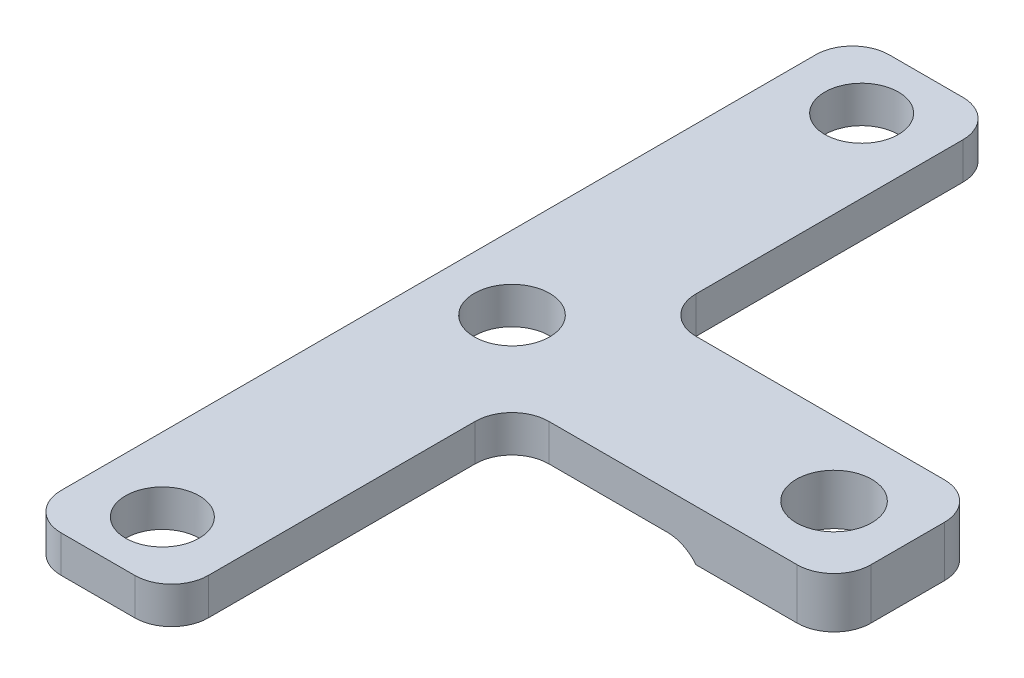
ISO-10303-21;
HEADER;
FILE_DESCRIPTION(('STEP AP214'),'2;1');
FILE_NAME('part.step','',(''),(''),'','','');
FILE_SCHEMA(('AUTOMOTIVE_DESIGN { 1 0 10303 214 1 1 1 1 }'));
ENDSEC;
DATA;
#1=APPLICATION_CONTEXT('core data for automotive mechanical design processes');
#2=APPLICATION_PROTOCOL_DEFINITION('international standard','automotive_design',2000,#1);
#3=PRODUCT_CONTEXT('',#1,'mechanical');
#4=PRODUCT('Part','Part','',(#3));
#5=PRODUCT_RELATED_PRODUCT_CATEGORY('part','',(#4));
#6=PRODUCT_DEFINITION_FORMATION('','',#4);
#7=PRODUCT_DEFINITION_CONTEXT('part definition',#1,'design');
#8=PRODUCT_DEFINITION('design','',#6,#7);
#9=PRODUCT_DEFINITION_SHAPE('','',#8);
#10=(LENGTH_UNIT() NAMED_UNIT(*) SI_UNIT(.MILLI.,.METRE.));
#11=(NAMED_UNIT(*) PLANE_ANGLE_UNIT() SI_UNIT($,.RADIAN.));
#12=(NAMED_UNIT(*) SI_UNIT($,.STERADIAN.) SOLID_ANGLE_UNIT());
#13=UNCERTAINTY_MEASURE_WITH_UNIT(LENGTH_MEASURE(1.E-05),#10,'distance_accuracy_value','');
#14=(GEOMETRIC_REPRESENTATION_CONTEXT(3) GLOBAL_UNCERTAINTY_ASSIGNED_CONTEXT((#13)) GLOBAL_UNIT_ASSIGNED_CONTEXT((#10,
#11,#12)) REPRESENTATION_CONTEXT('',''));
#15=CARTESIAN_POINT('',(0.,0.,0.));
#16=DIRECTION('',(0.,0.,1.));
#17=DIRECTION('',(1.,0.,0.));
#18=AXIS2_PLACEMENT_3D('',#15,#16,#17);
#19=CARTESIAN_POINT('',(0.,0.,0.));
#20=DIRECTION('',(0.,-1.,0.));
#21=DIRECTION('',(0.,0.,-1.));
#22=AXIS2_PLACEMENT_3D('',#19,#20,#21);
#23=PLANE('',#22);
#24=CARTESIAN_POINT('',(0.,0.,0.));
#25=DIRECTION('',(0.,1.,0.));
#26=DIRECTION('',(0.,0.,1.));
#27=AXIS2_PLACEMENT_3D('',#24,#25,#26);
#28=CIRCLE('',#27,4.1);
#29=CARTESIAN_POINT('',(0.,0.,4.1));
#30=VERTEX_POINT('',#29);
#31=EDGE_CURVE('E297',#30,#30,#28,.T.);
#32=ORIENTED_EDGE('',*,*,#31,.T.);
#33=EDGE_LOOP('',(#32));
#34=FACE_BOUND('',#33,.T.);
#35=CARTESIAN_POINT('',(0.,0.,38.));
#36=DIRECTION('',(0.,-1.,0.));
#37=DIRECTION('',(0.,0.,-1.));
#38=AXIS2_PLACEMENT_3D('',#35,#36,#37);
#39=CIRCLE('',#38,4.);
#40=CARTESIAN_POINT('',(0.,0.,34.));
#41=VERTEX_POINT('',#40);
#42=EDGE_CURVE('E293',#41,#41,#39,.T.);
#43=ORIENTED_EDGE('',*,*,#42,.F.);
#44=EDGE_LOOP('',(#43));
#45=FACE_BOUND('',#44,.T.);
#46=CARTESIAN_POINT('',(0.,0.,-38.));
#47=DIRECTION('',(0.,-1.,0.));
#48=DIRECTION('',(0.,0.,-1.));
#49=AXIS2_PLACEMENT_3D('',#46,#47,#48);
#50=CIRCLE('',#49,4.);
#51=CARTESIAN_POINT('',(0.,0.,-42.));
#52=VERTEX_POINT('',#51);
#53=EDGE_CURVE('E287',#52,#52,#50,.F.);
#54=ORIENTED_EDGE('',*,*,#53,.T.);
#55=EDGE_LOOP('',(#54));
#56=FACE_BOUND('',#55,.T.);
#57=DIRECTION('',(-1.,0.,0.));
#58=VECTOR('',#57,1.);
#59=CARTESIAN_POINT('',(8.00000000000001,0.,-8.));
#60=LINE('',#59,#58);
#61=CARTESIAN_POINT('',(24.8775010008008,0.,-8.));
#62=VERTEX_POINT('',#61);
#63=CARTESIAN_POINT('',(12.,0.,-8.));
#64=VERTEX_POINT('',#63);
#65=EDGE_CURVE('E322',#62,#64,#60,.T.);
#66=ORIENTED_EDGE('',*,*,#65,.F.);
#67=DIRECTION('',(0.,0.,-1.));
#68=VECTOR('',#67,1.);
#69=CARTESIAN_POINT('',(24.8775010008008,0.,8.));
#70=LINE('',#69,#68);
#71=CARTESIAN_POINT('',(24.8775010008008,0.,8.));
#72=VERTEX_POINT('',#71);
#73=EDGE_CURVE('E182',#62,#72,#70,.F.);
#74=ORIENTED_EDGE('',*,*,#73,.T.);
#75=DIRECTION('',(1.,0.,0.));
#76=VECTOR('',#75,1.);
#77=CARTESIAN_POINT('',(8.00000000000001,0.,8.));
#78=LINE('',#77,#76);
#79=CARTESIAN_POINT('',(12.,0.,8.));
#80=VERTEX_POINT('',#79);
#81=EDGE_CURVE('E298',#80,#72,#78,.T.);
#82=ORIENTED_EDGE('',*,*,#81,.F.);
#83=CARTESIAN_POINT('',(12.,0.,12.));
#84=DIRECTION('',(0.,-1.,0.));
#85=DIRECTION('',(0.,0.,-1.));
#86=AXIS2_PLACEMENT_3D('',#83,#84,#85);
#87=CIRCLE('',#86,4.);
#88=CARTESIAN_POINT('',(8.,0.,12.));
#89=VERTEX_POINT('',#88);
#90=EDGE_CURVE('E191',#80,#89,#87,.F.);
#91=ORIENTED_EDGE('',*,*,#90,.T.);
#92=DIRECTION('',(0.,0.,-1.));
#93=VECTOR('',#92,1.);
#94=CARTESIAN_POINT('',(8.00000000000001,0.,8.));
#95=LINE('',#94,#93);
#96=CARTESIAN_POINT('',(7.99999999999999,0.,41.));
#97=VERTEX_POINT('',#96);
#98=EDGE_CURVE('E302',#97,#89,#95,.T.);
#99=ORIENTED_EDGE('',*,*,#98,.F.);
#100=CARTESIAN_POINT('',(3.99999999999999,0.,41.));
#101=DIRECTION('',(0.,-1.,0.));
#102=DIRECTION('',(0.,0.,-1.));
#103=AXIS2_PLACEMENT_3D('',#100,#101,#102);
#104=CIRCLE('',#103,4.);
#105=CARTESIAN_POINT('',(3.99999999999999,0.,45.));
#106=VERTEX_POINT('',#105);
#107=EDGE_CURVE('E269',#97,#106,#104,.T.);
#108=ORIENTED_EDGE('',*,*,#107,.T.);
#109=DIRECTION('',(1.,0.,0.));
#110=VECTOR('',#109,1.);
#111=CARTESIAN_POINT('',(-7.99999999999999,0.,45.));
#112=LINE('',#111,#110);
#113=CARTESIAN_POINT('',(-3.99999999999999,0.,45.));
#114=VERTEX_POINT('',#113);
#115=EDGE_CURVE('E306',#114,#106,#112,.T.);
#116=ORIENTED_EDGE('',*,*,#115,.F.);
#117=CARTESIAN_POINT('',(-3.99999999999999,0.,41.));
#118=DIRECTION('',(0.,-1.,0.));
#119=DIRECTION('',(0.,0.,-1.));
#120=AXIS2_PLACEMENT_3D('',#117,#118,#119);
#121=CIRCLE('',#120,4.);
#122=CARTESIAN_POINT('',(-7.99999999999999,0.,41.));
#123=VERTEX_POINT('',#122);
#124=EDGE_CURVE('E278',#114,#123,#121,.T.);
#125=ORIENTED_EDGE('',*,*,#124,.T.);
#126=DIRECTION('',(0.,0.,1.));
#127=VECTOR('',#126,1.);
#128=CARTESIAN_POINT('',(-8.,0.,-45.));
#129=LINE('',#128,#127);
#130=CARTESIAN_POINT('',(-8.,0.,-41.));
#131=VERTEX_POINT('',#130);
#132=EDGE_CURVE('E310',#131,#123,#129,.T.);
#133=ORIENTED_EDGE('',*,*,#132,.F.);
#134=CARTESIAN_POINT('',(-4.,0.,-41.));
#135=DIRECTION('',(0.,-1.,0.));
#136=DIRECTION('',(0.,0.,-1.));
#137=AXIS2_PLACEMENT_3D('',#134,#135,#136);
#138=CIRCLE('',#137,4.);
#139=CARTESIAN_POINT('',(-4.,0.,-45.));
#140=VERTEX_POINT('',#139);
#141=EDGE_CURVE('E275',#131,#140,#138,.T.);
#142=ORIENTED_EDGE('',*,*,#141,.T.);
#143=DIRECTION('',(-1.,0.,0.));
#144=VECTOR('',#143,1.);
#145=CARTESIAN_POINT('',(-8.,0.,-45.));
#146=LINE('',#145,#144);
#147=CARTESIAN_POINT('',(4.,0.,-45.));
#148=VERTEX_POINT('',#147);
#149=EDGE_CURVE('E314',#148,#140,#146,.T.);
#150=ORIENTED_EDGE('',*,*,#149,.F.);
#151=CARTESIAN_POINT('',(4.,0.,-41.));
#152=DIRECTION('',(0.,-1.,0.));
#153=DIRECTION('',(0.,0.,-1.));
#154=AXIS2_PLACEMENT_3D('',#151,#152,#153);
#155=CIRCLE('',#154,4.);
#156=CARTESIAN_POINT('',(8.,0.,-41.));
#157=VERTEX_POINT('',#156);
#158=EDGE_CURVE('E272',#148,#157,#155,.T.);
#159=ORIENTED_EDGE('',*,*,#158,.T.);
#160=DIRECTION('',(0.,0.,-1.));
#161=VECTOR('',#160,1.);
#162=CARTESIAN_POINT('',(8.,0.,-45.));
#163=LINE('',#162,#161);
#164=CARTESIAN_POINT('',(8.00000000000001,0.,-12.));
#165=VERTEX_POINT('',#164);
#166=EDGE_CURVE('E318',#165,#157,#163,.T.);
#167=ORIENTED_EDGE('',*,*,#166,.F.);
#168=CARTESIAN_POINT('',(12.,0.,-12.));
#169=DIRECTION('',(0.,-1.,0.));
#170=DIRECTION('',(0.,0.,-1.));
#171=AXIS2_PLACEMENT_3D('',#168,#169,#170);
#172=CIRCLE('',#171,4.);
#173=EDGE_CURVE('E199',#165,#64,#172,.F.);
#174=ORIENTED_EDGE('',*,*,#173,.T.);
#175=EDGE_LOOP('',(#66,#74,#82,#91,#99,#108,#116,#125,#133,#142,#150,#159,#167,#174));
#176=FACE_BOUND('',#175,.T.);
#177=ADVANCED_FACE('F39',(#34,#45,#56,#176),#23,.T.);
#178=CARTESIAN_POINT('',(0.,4.,0.));
#179=DIRECTION('',(0.,-1.,0.));
#180=DIRECTION('',(0.,0.,-1.));
#181=AXIS2_PLACEMENT_3D('',#178,#179,#180);
#182=PLANE('',#181);
#183=CARTESIAN_POINT('',(35.,4.,0.));
#184=DIRECTION('',(0.,1.,0.));
#185=DIRECTION('',(0.,0.,1.));
#186=AXIS2_PLACEMENT_3D('',#183,#184,#185);
#187=CIRCLE('',#186,4.1);
#188=CARTESIAN_POINT('',(35.,4.,4.1));
#189=VERTEX_POINT('',#188);
#190=EDGE_CURVE('E368',#189,#189,#187,.T.);
#191=ORIENTED_EDGE('',*,*,#190,.F.);
#192=EDGE_LOOP('',(#191));
#193=FACE_BOUND('',#192,.T.);
#194=CARTESIAN_POINT('',(0.,4.,-38.));
#195=DIRECTION('',(0.,-1.,0.));
#196=DIRECTION('',(0.,0.,-1.));
#197=AXIS2_PLACEMENT_3D('',#194,#195,#196);
#198=CIRCLE('',#197,4.);
#199=CARTESIAN_POINT('',(0.,4.,-42.));
#200=VERTEX_POINT('',#199);
#201=EDGE_CURVE('E292',#200,#200,#198,.T.);
#202=ORIENTED_EDGE('',*,*,#201,.T.);
#203=EDGE_LOOP('',(#202));
#204=FACE_BOUND('',#203,.T.);
#205=CARTESIAN_POINT('',(0.,4.,38.));
#206=DIRECTION('',(0.,1.,0.));
#207=DIRECTION('',(0.,0.,1.));
#208=AXIS2_PLACEMENT_3D('',#205,#206,#207);
#209=CIRCLE('',#208,4.);
#210=CARTESIAN_POINT('',(0.,4.,42.));
#211=VERTEX_POINT('',#210);
#212=EDGE_CURVE('E291',#211,#211,#209,.T.);
#213=ORIENTED_EDGE('',*,*,#212,.F.);
#214=EDGE_LOOP('',(#213));
#215=FACE_BOUND('',#214,.T.);
#216=DIRECTION('',(0.,0.,-1.));
#217=VECTOR('',#216,1.);
#218=CARTESIAN_POINT('',(43.,4.,-8.));
#219=LINE('',#218,#217);
#220=CARTESIAN_POINT('',(43.,4.,4.));
#221=VERTEX_POINT('',#220);
#222=CARTESIAN_POINT('',(43.,4.,-4.));
#223=VERTEX_POINT('',#222);
#224=EDGE_CURVE('E286',#221,#223,#219,.T.);
#225=ORIENTED_EDGE('',*,*,#224,.T.);
#226=CARTESIAN_POINT('',(39.,4.,-4.));
#227=DIRECTION('',(0.,-1.,0.));
#228=DIRECTION('',(0.,0.,-1.));
#229=AXIS2_PLACEMENT_3D('',#226,#227,#228);
#230=CIRCLE('',#229,4.);
#231=CARTESIAN_POINT('',(39.,4.,-8.));
#232=VERTEX_POINT('',#231);
#233=EDGE_CURVE('E245',#223,#232,#230,.F.);
#234=ORIENTED_EDGE('',*,*,#233,.T.);
#235=DIRECTION('',(-1.,0.,0.));
#236=VECTOR('',#235,1.);
#237=CARTESIAN_POINT('',(8.00000000000001,4.,-8.));
#238=LINE('',#237,#236);
#239=CARTESIAN_POINT('',(12.,4.,-8.));
#240=VERTEX_POINT('',#239);
#241=EDGE_CURVE('E301',#232,#240,#238,.T.);
#242=ORIENTED_EDGE('',*,*,#241,.T.);
#243=CARTESIAN_POINT('',(12.,4.,-12.));
#244=DIRECTION('',(0.,-1.,0.));
#245=DIRECTION('',(0.,0.,-1.));
#246=AXIS2_PLACEMENT_3D('',#243,#244,#245);
#247=CIRCLE('',#246,4.);
#248=CARTESIAN_POINT('',(8.00000000000001,4.,-12.));
#249=VERTEX_POINT('',#248);
#250=EDGE_CURVE('E196',#240,#249,#247,.T.);
#251=ORIENTED_EDGE('',*,*,#250,.T.);
#252=DIRECTION('',(0.,0.,-1.));
#253=VECTOR('',#252,1.);
#254=CARTESIAN_POINT('',(8.,4.,-45.));
#255=LINE('',#254,#253);
#256=CARTESIAN_POINT('',(8.,4.,-41.));
#257=VERTEX_POINT('',#256);
#258=EDGE_CURVE('E349',#249,#257,#255,.T.);
#259=ORIENTED_EDGE('',*,*,#258,.T.);
#260=CARTESIAN_POINT('',(4.,4.,-41.));
#261=DIRECTION('',(0.,-1.,0.));
#262=DIRECTION('',(0.,0.,-1.));
#263=AXIS2_PLACEMENT_3D('',#260,#261,#262);
#264=CIRCLE('',#263,4.);
#265=CARTESIAN_POINT('',(4.,4.,-45.));
#266=VERTEX_POINT('',#265);
#267=EDGE_CURVE('E254',#257,#266,#264,.F.);
#268=ORIENTED_EDGE('',*,*,#267,.T.);
#269=DIRECTION('',(-1.,0.,0.));
#270=VECTOR('',#269,1.);
#271=CARTESIAN_POINT('',(-8.,4.,-45.));
#272=LINE('',#271,#270);
#273=CARTESIAN_POINT('',(-4.,4.,-45.));
#274=VERTEX_POINT('',#273);
#275=EDGE_CURVE('E345',#266,#274,#272,.T.);
#276=ORIENTED_EDGE('',*,*,#275,.T.);
#277=CARTESIAN_POINT('',(-4.,4.,-41.));
#278=DIRECTION('',(0.,-1.,0.));
#279=DIRECTION('',(0.,0.,-1.));
#280=AXIS2_PLACEMENT_3D('',#277,#278,#279);
#281=CIRCLE('',#280,4.);
#282=CARTESIAN_POINT('',(-8.,4.,-41.));
#283=VERTEX_POINT('',#282);
#284=EDGE_CURVE('E257',#274,#283,#281,.F.);
#285=ORIENTED_EDGE('',*,*,#284,.T.);
#286=DIRECTION('',(0.,0.,1.));
#287=VECTOR('',#286,1.);
#288=CARTESIAN_POINT('',(-8.,4.,-45.));
#289=LINE('',#288,#287);
#290=CARTESIAN_POINT('',(-7.99999999999999,4.,41.));
#291=VERTEX_POINT('',#290);
#292=EDGE_CURVE('E341',#283,#291,#289,.T.);
#293=ORIENTED_EDGE('',*,*,#292,.T.);
#294=CARTESIAN_POINT('',(-3.99999999999999,4.,41.));
#295=DIRECTION('',(0.,-1.,0.));
#296=DIRECTION('',(0.,0.,-1.));
#297=AXIS2_PLACEMENT_3D('',#294,#295,#296);
#298=CIRCLE('',#297,4.);
#299=CARTESIAN_POINT('',(-3.99999999999999,4.,45.));
#300=VERTEX_POINT('',#299);
#301=EDGE_CURVE('E260',#291,#300,#298,.F.);
#302=ORIENTED_EDGE('',*,*,#301,.T.);
#303=DIRECTION('',(1.,0.,0.));
#304=VECTOR('',#303,1.);
#305=CARTESIAN_POINT('',(-7.99999999999999,4.,45.));
#306=LINE('',#305,#304);
#307=CARTESIAN_POINT('',(3.99999999999999,4.,45.));
#308=VERTEX_POINT('',#307);
#309=EDGE_CURVE('E337',#300,#308,#306,.T.);
#310=ORIENTED_EDGE('',*,*,#309,.T.);
#311=CARTESIAN_POINT('',(3.99999999999999,4.,41.));
#312=DIRECTION('',(0.,-1.,0.));
#313=DIRECTION('',(0.,0.,-1.));
#314=AXIS2_PLACEMENT_3D('',#311,#312,#313);
#315=CIRCLE('',#314,4.);
#316=CARTESIAN_POINT('',(7.99999999999999,4.,41.));
#317=VERTEX_POINT('',#316);
#318=EDGE_CURVE('E251',#308,#317,#315,.F.);
#319=ORIENTED_EDGE('',*,*,#318,.T.);
#320=DIRECTION('',(0.,0.,-1.));
#321=VECTOR('',#320,1.);
#322=CARTESIAN_POINT('',(8.00000000000001,4.,8.));
#323=LINE('',#322,#321);
#324=CARTESIAN_POINT('',(8.,4.,12.));
#325=VERTEX_POINT('',#324);
#326=EDGE_CURVE('E333',#317,#325,#323,.T.);
#327=ORIENTED_EDGE('',*,*,#326,.T.);
#328=CARTESIAN_POINT('',(12.,4.,12.));
#329=DIRECTION('',(0.,-1.,0.));
#330=DIRECTION('',(0.,0.,-1.));
#331=AXIS2_PLACEMENT_3D('',#328,#329,#330);
#332=CIRCLE('',#331,4.);
#333=CARTESIAN_POINT('',(12.,4.,8.));
#334=VERTEX_POINT('',#333);
#335=EDGE_CURVE('E187',#325,#334,#332,.T.);
#336=ORIENTED_EDGE('',*,*,#335,.T.);
#337=DIRECTION('',(1.,0.,0.));
#338=VECTOR('',#337,1.);
#339=CARTESIAN_POINT('',(8.00000000000001,4.,8.));
#340=LINE('',#339,#338);
#341=CARTESIAN_POINT('',(39.,4.,8.));
#342=VERTEX_POINT('',#341);
#343=EDGE_CURVE('E329',#334,#342,#340,.T.);
#344=ORIENTED_EDGE('',*,*,#343,.T.);
#345=CARTESIAN_POINT('',(39.,4.,4.));
#346=DIRECTION('',(0.,-1.,0.));
#347=DIRECTION('',(0.,0.,-1.));
#348=AXIS2_PLACEMENT_3D('',#345,#346,#347);
#349=CIRCLE('',#348,4.);
#350=EDGE_CURVE('E248',#342,#221,#349,.F.);
#351=ORIENTED_EDGE('',*,*,#350,.T.);
#352=EDGE_LOOP('',(#225,#234,#242,#251,#259,#268,#276,#285,#293,#302,#310,#319,#327,#336,#344,#351));
#353=FACE_BOUND('',#352,.T.);
#354=CARTESIAN_POINT('',(0.,4.,0.));
#355=DIRECTION('',(0.,1.,0.));
#356=DIRECTION('',(0.,0.,1.));
#357=AXIS2_PLACEMENT_3D('',#354,#355,#356);
#358=CIRCLE('',#357,4.1);
#359=CARTESIAN_POINT('',(0.,4.,4.1));
#360=VERTEX_POINT('',#359);
#361=EDGE_CURVE('E325',#360,#360,#358,.T.);
#362=ORIENTED_EDGE('',*,*,#361,.F.);
#363=EDGE_LOOP('',(#362));
#364=FACE_BOUND('',#363,.T.);
#365=ADVANCED_FACE('F410',(#193,#204,#215,#353,#364),#182,.F.);
#366=CARTESIAN_POINT('',(8.00000000000001,4.,-8.));
#367=DIRECTION('',(0.,0.,1.));
#368=DIRECTION('',(1.,0.,0.));
#369=AXIS2_PLACEMENT_3D('',#366,#367,#368);
#370=PLANE('',#369);
#371=ORIENTED_EDGE('',*,*,#241,.F.);
#372=DIRECTION('',(0.,-1.,0.));
#373=VECTOR('',#372,1.);
#374=CARTESIAN_POINT('',(39.,4.,-8.));
#375=LINE('',#374,#373);
#376=CARTESIAN_POINT('',(39.,-1.5,-8.));
#377=VERTEX_POINT('',#376);
#378=EDGE_CURVE('E166',#232,#377,#375,.T.);
#379=ORIENTED_EDGE('',*,*,#378,.T.);
#380=DIRECTION('',(1.,0.,0.));
#381=VECTOR('',#380,1.);
#382=CARTESIAN_POINT('',(0.,-1.5,-8.));
#383=LINE('',#382,#381);
#384=CARTESIAN_POINT('',(28.,-1.5,-8.));
#385=VERTEX_POINT('',#384);
#386=EDGE_CURVE('E161',#385,#377,#383,.T.);
#387=ORIENTED_EDGE('',*,*,#386,.F.);
#388=CARTESIAN_POINT('',(24.8775010008008,-4.,-8.));
#389=DIRECTION('',(0.,0.,1.));
#390=DIRECTION('',(1.,0.,0.));
#391=AXIS2_PLACEMENT_3D('',#388,#389,#390);
#392=CIRCLE('',#391,4.);
#393=EDGE_CURVE('E11',#385,#62,#392,.T.);
#394=ORIENTED_EDGE('',*,*,#393,.T.);
#395=ORIENTED_EDGE('',*,*,#65,.T.);
#396=DIRECTION('',(0.,-1.,0.));
#397=VECTOR('',#396,1.);
#398=CARTESIAN_POINT('',(12.,4.,-8.));
#399=LINE('',#398,#397);
#400=EDGE_CURVE('E283',#64,#240,#399,.F.);
#401=ORIENTED_EDGE('',*,*,#400,.T.);
#402=EDGE_LOOP('',(#371,#379,#387,#394,#395,#401));
#403=FACE_BOUND('',#402,.T.);
#404=ADVANCED_FACE('F164',(#403),#370,.F.);
#405=CARTESIAN_POINT('',(8.,4.,-45.));
#406=DIRECTION('',(-1.,0.,0.));
#407=DIRECTION('',(0.,0.,1.));
#408=AXIS2_PLACEMENT_3D('',#405,#406,#407);
#409=PLANE('',#408);
#410=ORIENTED_EDGE('',*,*,#258,.F.);
#411=DIRECTION('',(0.,-1.,0.));
#412=VECTOR('',#411,1.);
#413=CARTESIAN_POINT('',(8.00000000000001,0.,-12.));
#414=LINE('',#413,#412);
#415=EDGE_CURVE('E231',#249,#165,#414,.T.);
#416=ORIENTED_EDGE('',*,*,#415,.T.);
#417=ORIENTED_EDGE('',*,*,#166,.T.);
#418=DIRECTION('',(0.,-1.,0.));
#419=VECTOR('',#418,1.);
#420=CARTESIAN_POINT('',(8.,4.,-41.));
#421=LINE('',#420,#419);
#422=EDGE_CURVE('E235',#157,#257,#421,.F.);
#423=ORIENTED_EDGE('',*,*,#422,.T.);
#424=EDGE_LOOP('',(#410,#416,#417,#423));
#425=FACE_BOUND('',#424,.T.);
#426=ADVANCED_FACE('F446',(#425),#409,.F.);
#427=CARTESIAN_POINT('',(-8.,4.,-45.));
#428=DIRECTION('',(0.,0.,1.));
#429=DIRECTION('',(1.,0.,0.));
#430=AXIS2_PLACEMENT_3D('',#427,#428,#429);
#431=PLANE('',#430);
#432=ORIENTED_EDGE('',*,*,#275,.F.);
#433=DIRECTION('',(0.,-1.,0.));
#434=VECTOR('',#433,1.);
#435=CARTESIAN_POINT('',(4.,4.,-45.));
#436=LINE('',#435,#434);
#437=EDGE_CURVE('E210',#266,#148,#436,.T.);
#438=ORIENTED_EDGE('',*,*,#437,.T.);
#439=ORIENTED_EDGE('',*,*,#149,.T.);
#440=DIRECTION('',(0.,-1.,0.));
#441=VECTOR('',#440,1.);
#442=CARTESIAN_POINT('',(-4.,4.,-45.));
#443=LINE('',#442,#441);
#444=EDGE_CURVE('E214',#140,#274,#443,.F.);
#445=ORIENTED_EDGE('',*,*,#444,.T.);
#446=EDGE_LOOP('',(#432,#438,#439,#445));
#447=FACE_BOUND('',#446,.T.);
#448=ADVANCED_FACE('F437',(#447),#431,.F.);
#449=CARTESIAN_POINT('',(-8.,4.,-45.));
#450=DIRECTION('',(1.,0.,0.));
#451=DIRECTION('',(0.,0.,-1.));
#452=AXIS2_PLACEMENT_3D('',#449,#450,#451);
#453=PLANE('',#452);
#454=ORIENTED_EDGE('',*,*,#292,.F.);
#455=DIRECTION('',(0.,-1.,0.));
#456=VECTOR('',#455,1.);
#457=CARTESIAN_POINT('',(-8.,4.,-41.));
#458=LINE('',#457,#456);
#459=EDGE_CURVE('E203',#283,#131,#458,.T.);
#460=ORIENTED_EDGE('',*,*,#459,.T.);
#461=ORIENTED_EDGE('',*,*,#132,.T.);
#462=DIRECTION('',(0.,-1.,0.));
#463=VECTOR('',#462,1.);
#464=CARTESIAN_POINT('',(-7.99999999999999,4.,41.));
#465=LINE('',#464,#463);
#466=EDGE_CURVE('E207',#123,#291,#465,.F.);
#467=ORIENTED_EDGE('',*,*,#466,.T.);
#468=EDGE_LOOP('',(#454,#460,#461,#467));
#469=FACE_BOUND('',#468,.T.);
#470=ADVANCED_FACE('F428',(#469),#453,.F.);
#471=CARTESIAN_POINT('',(-7.99999999999999,4.,45.));
#472=DIRECTION('',(0.,0.,-1.));
#473=DIRECTION('',(-1.,0.,0.));
#474=AXIS2_PLACEMENT_3D('',#471,#472,#473);
#475=PLANE('',#474);
#476=ORIENTED_EDGE('',*,*,#115,.T.);
#477=DIRECTION('',(0.,-1.,0.));
#478=VECTOR('',#477,1.);
#479=CARTESIAN_POINT('',(3.99999999999999,4.,45.));
#480=LINE('',#479,#478);
#481=EDGE_CURVE('E217',#106,#308,#480,.F.);
#482=ORIENTED_EDGE('',*,*,#481,.T.);
#483=ORIENTED_EDGE('',*,*,#309,.F.);
#484=DIRECTION('',(0.,-1.,0.));
#485=VECTOR('',#484,1.);
#486=CARTESIAN_POINT('',(-3.99999999999999,4.,45.));
#487=LINE('',#486,#485);
#488=EDGE_CURVE('E220',#300,#114,#487,.T.);
#489=ORIENTED_EDGE('',*,*,#488,.T.);
#490=EDGE_LOOP('',(#476,#482,#483,#489));
#491=FACE_BOUND('',#490,.T.);
#492=ADVANCED_FACE('F418',(#491),#475,.F.);
#493=CARTESIAN_POINT('',(8.00000000000001,4.,8.));
#494=DIRECTION('',(-1.,0.,0.));
#495=DIRECTION('',(0.,0.,1.));
#496=AXIS2_PLACEMENT_3D('',#493,#494,#495);
#497=PLANE('',#496);
#498=ORIENTED_EDGE('',*,*,#98,.T.);
#499=DIRECTION('',(0.,-1.,0.));
#500=VECTOR('',#499,1.);
#501=CARTESIAN_POINT('',(8.,4.,12.));
#502=LINE('',#501,#500);
#503=EDGE_CURVE('E224',#89,#325,#502,.F.);
#504=ORIENTED_EDGE('',*,*,#503,.T.);
#505=ORIENTED_EDGE('',*,*,#326,.F.);
#506=DIRECTION('',(0.,-1.,0.));
#507=VECTOR('',#506,1.);
#508=CARTESIAN_POINT('',(7.99999999999999,4.,41.));
#509=LINE('',#508,#507);
#510=EDGE_CURVE('E227',#317,#97,#509,.T.);
#511=ORIENTED_EDGE('',*,*,#510,.T.);
#512=EDGE_LOOP('',(#498,#504,#505,#511));
#513=FACE_BOUND('',#512,.T.);
#514=ADVANCED_FACE('F404',(#513),#497,.F.);
#515=CARTESIAN_POINT('',(8.00000000000001,4.,8.));
#516=DIRECTION('',(0.,0.,-1.));
#517=DIRECTION('',(-1.,0.,0.));
#518=AXIS2_PLACEMENT_3D('',#515,#516,#517);
#519=PLANE('',#518);
#520=ORIENTED_EDGE('',*,*,#81,.T.);
#521=CARTESIAN_POINT('',(24.8775010008008,-4.,8.));
#522=DIRECTION('',(0.,0.,-1.));
#523=DIRECTION('',(-1.,0.,0.));
#524=AXIS2_PLACEMENT_3D('',#521,#522,#523);
#525=CIRCLE('',#524,4.);
#526=CARTESIAN_POINT('',(28.,-1.5,8.));
#527=VERTEX_POINT('',#526);
#528=EDGE_CURVE('E48',#72,#527,#525,.T.);
#529=ORIENTED_EDGE('',*,*,#528,.T.);
#530=DIRECTION('',(-1.,0.,0.));
#531=VECTOR('',#530,1.);
#532=CARTESIAN_POINT('',(0.,-1.5,8.));
#533=LINE('',#532,#531);
#534=CARTESIAN_POINT('',(39.,-1.5,8.));
#535=VERTEX_POINT('',#534);
#536=EDGE_CURVE('E179',#535,#527,#533,.T.);
#537=ORIENTED_EDGE('',*,*,#536,.F.);
#538=DIRECTION('',(0.,-1.,0.));
#539=VECTOR('',#538,1.);
#540=CARTESIAN_POINT('',(39.,4.,8.));
#541=LINE('',#540,#539);
#542=EDGE_CURVE('E238',#535,#342,#541,.F.);
#543=ORIENTED_EDGE('',*,*,#542,.T.);
#544=ORIENTED_EDGE('',*,*,#343,.F.);
#545=DIRECTION('',(0.,-1.,0.));
#546=VECTOR('',#545,1.);
#547=CARTESIAN_POINT('',(12.,0.,8.));
#548=LINE('',#547,#546);
#549=EDGE_CURVE('E241',#334,#80,#548,.T.);
#550=ORIENTED_EDGE('',*,*,#549,.T.);
#551=EDGE_LOOP('',(#520,#529,#537,#543,#544,#550));
#552=FACE_BOUND('',#551,.T.);
#553=ADVANCED_FACE('F397',(#552),#519,.F.);
#554=CARTESIAN_POINT('',(43.,4.,-8.));
#555=DIRECTION('',(-1.,0.,0.));
#556=DIRECTION('',(0.,0.,1.));
#557=AXIS2_PLACEMENT_3D('',#554,#555,#556);
#558=PLANE('',#557);
#559=DIRECTION('',(0.,-1.,0.));
#560=VECTOR('',#559,1.);
#561=CARTESIAN_POINT('',(43.,4.,4.));
#562=LINE('',#561,#560);
#563=CARTESIAN_POINT('',(43.,-1.5,4.));
#564=VERTEX_POINT('',#563);
#565=EDGE_CURVE('E266',#221,#564,#562,.T.);
#566=ORIENTED_EDGE('',*,*,#565,.T.);
#567=DIRECTION('',(0.,0.,1.));
#568=VECTOR('',#567,1.);
#569=CARTESIAN_POINT('',(43.,-1.5,0.));
#570=LINE('',#569,#568);
#571=CARTESIAN_POINT('',(43.,-1.5,-4.));
#572=VERTEX_POINT('',#571);
#573=EDGE_CURVE('E381',#572,#564,#570,.T.);
#574=ORIENTED_EDGE('',*,*,#573,.F.);
#575=DIRECTION('',(0.,-1.,0.));
#576=VECTOR('',#575,1.);
#577=CARTESIAN_POINT('',(43.,4.,-4.));
#578=LINE('',#577,#576);
#579=EDGE_CURVE('E263',#572,#223,#578,.F.);
#580=ORIENTED_EDGE('',*,*,#579,.T.);
#581=ORIENTED_EDGE('',*,*,#224,.F.);
#582=EDGE_LOOP('',(#566,#574,#580,#581));
#583=FACE_BOUND('',#582,.T.);
#584=ADVANCED_FACE('F390',(#583),#558,.F.);
#585=CARTESIAN_POINT('',(0.,4.,0.));
#586=DIRECTION('',(0.,-1.,0.));
#587=DIRECTION('',(0.,0.,-1.));
#588=AXIS2_PLACEMENT_3D('',#585,#586,#587);
#589=CYLINDRICAL_SURFACE('',#588,4.1);
#590=ORIENTED_EDGE('',*,*,#361,.T.);
#591=EDGE_LOOP('',(#590));
#592=FACE_BOUND('',#591,.T.);
#593=ORIENTED_EDGE('',*,*,#31,.F.);
#594=EDGE_LOOP('',(#593));
#595=FACE_BOUND('',#594,.T.);
#596=ADVANCED_FACE('F479',(#592,#595),#589,.F.);
#597=CARTESIAN_POINT('',(0.,-6.,38.));
#598=DIRECTION('',(0.,1.,0.));
#599=DIRECTION('',(0.,0.,1.));
#600=AXIS2_PLACEMENT_3D('',#597,#598,#599);
#601=CYLINDRICAL_SURFACE('',#600,4.);
#602=ORIENTED_EDGE('',*,*,#42,.T.);
#603=EDGE_LOOP('',(#602));
#604=FACE_BOUND('',#603,.T.);
#605=ORIENTED_EDGE('',*,*,#212,.T.);
#606=EDGE_LOOP('',(#605));
#607=FACE_BOUND('',#606,.T.);
#608=ADVANCED_FACE('F462',(#604,#607),#601,.F.);
#609=CARTESIAN_POINT('',(0.,-6.,-38.));
#610=DIRECTION('',(0.,1.,0.));
#611=DIRECTION('',(0.,0.,1.));
#612=AXIS2_PLACEMENT_3D('',#609,#610,#611);
#613=CYLINDRICAL_SURFACE('',#612,4.);
#614=ORIENTED_EDGE('',*,*,#53,.F.);
#615=EDGE_LOOP('',(#614));
#616=FACE_BOUND('',#615,.T.);
#617=ORIENTED_EDGE('',*,*,#201,.F.);
#618=EDGE_LOOP('',(#617));
#619=FACE_BOUND('',#618,.T.);
#620=ADVANCED_FACE('F455',(#616,#619),#613,.F.);
#621=CARTESIAN_POINT('',(39.,4.,-4.));
#622=DIRECTION('',(0.,-1.,0.));
#623=DIRECTION('',(0.,0.,-1.));
#624=AXIS2_PLACEMENT_3D('',#621,#622,#623);
#625=CYLINDRICAL_SURFACE('',#624,4.);
#626=ORIENTED_EDGE('',*,*,#233,.F.);
#627=ORIENTED_EDGE('',*,*,#579,.F.);
#628=CARTESIAN_POINT('',(39.,-1.5,-4.));
#629=DIRECTION('',(0.,-1.,0.));
#630=DIRECTION('',(0.,0.,-1.));
#631=AXIS2_PLACEMENT_3D('',#628,#629,#630);
#632=CIRCLE('',#631,4.);
#633=EDGE_CURVE('E171',#377,#572,#632,.T.);
#634=ORIENTED_EDGE('',*,*,#633,.F.);
#635=ORIENTED_EDGE('',*,*,#378,.F.);
#636=EDGE_LOOP('',(#626,#627,#634,#635));
#637=FACE_BOUND('',#636,.T.);
#638=ADVANCED_FACE('F453',(#637),#625,.T.);
#639=CARTESIAN_POINT('',(39.,4.,4.));
#640=DIRECTION('',(0.,-1.,0.));
#641=DIRECTION('',(0.,0.,-1.));
#642=AXIS2_PLACEMENT_3D('',#639,#640,#641);
#643=CYLINDRICAL_SURFACE('',#642,4.);
#644=ORIENTED_EDGE('',*,*,#350,.F.);
#645=ORIENTED_EDGE('',*,*,#542,.F.);
#646=CARTESIAN_POINT('',(39.,-1.5,4.));
#647=DIRECTION('',(0.,-1.,0.));
#648=DIRECTION('',(0.,0.,-1.));
#649=AXIS2_PLACEMENT_3D('',#646,#647,#648);
#650=CIRCLE('',#649,4.);
#651=EDGE_CURVE('E378',#564,#535,#650,.T.);
#652=ORIENTED_EDGE('',*,*,#651,.F.);
#653=ORIENTED_EDGE('',*,*,#565,.F.);
#654=EDGE_LOOP('',(#644,#645,#652,#653));
#655=FACE_BOUND('',#654,.T.);
#656=ADVANCED_FACE('F395',(#655),#643,.T.);
#657=CARTESIAN_POINT('',(12.,4.,-12.));
#658=DIRECTION('',(0.,1.,0.));
#659=DIRECTION('',(0.,0.,1.));
#660=AXIS2_PLACEMENT_3D('',#657,#658,#659);
#661=CYLINDRICAL_SURFACE('',#660,4.);
#662=ORIENTED_EDGE('',*,*,#250,.F.);
#663=ORIENTED_EDGE('',*,*,#400,.F.);
#664=ORIENTED_EDGE('',*,*,#173,.F.);
#665=ORIENTED_EDGE('',*,*,#415,.F.);
#666=EDGE_LOOP('',(#662,#663,#664,#665));
#667=FACE_BOUND('',#666,.T.);
#668=ADVANCED_FACE('F450',(#667),#661,.F.);
#669=CARTESIAN_POINT('',(12.,4.,12.));
#670=DIRECTION('',(0.,1.,0.));
#671=DIRECTION('',(0.,0.,1.));
#672=AXIS2_PLACEMENT_3D('',#669,#670,#671);
#673=CYLINDRICAL_SURFACE('',#672,4.);
#674=ORIENTED_EDGE('',*,*,#335,.F.);
#675=ORIENTED_EDGE('',*,*,#503,.F.);
#676=ORIENTED_EDGE('',*,*,#90,.F.);
#677=ORIENTED_EDGE('',*,*,#549,.F.);
#678=EDGE_LOOP('',(#674,#675,#676,#677));
#679=FACE_BOUND('',#678,.T.);
#680=ADVANCED_FACE('F408',(#679),#673,.F.);
#681=CARTESIAN_POINT('',(3.99999999999999,4.,41.));
#682=DIRECTION('',(0.,-1.,0.));
#683=DIRECTION('',(0.,0.,-1.));
#684=AXIS2_PLACEMENT_3D('',#681,#682,#683);
#685=CYLINDRICAL_SURFACE('',#684,4.);
#686=ORIENTED_EDGE('',*,*,#318,.F.);
#687=ORIENTED_EDGE('',*,*,#481,.F.);
#688=ORIENTED_EDGE('',*,*,#107,.F.);
#689=ORIENTED_EDGE('',*,*,#510,.F.);
#690=EDGE_LOOP('',(#686,#687,#688,#689));
#691=FACE_BOUND('',#690,.T.);
#692=ADVANCED_FACE('F414',(#691),#685,.T.);
#693=CARTESIAN_POINT('',(4.,4.,-41.));
#694=DIRECTION('',(0.,-1.,0.));
#695=DIRECTION('',(0.,0.,-1.));
#696=AXIS2_PLACEMENT_3D('',#693,#694,#695);
#697=CYLINDRICAL_SURFACE('',#696,4.);
#698=ORIENTED_EDGE('',*,*,#267,.F.);
#699=ORIENTED_EDGE('',*,*,#422,.F.);
#700=ORIENTED_EDGE('',*,*,#158,.F.);
#701=ORIENTED_EDGE('',*,*,#437,.F.);
#702=EDGE_LOOP('',(#698,#699,#700,#701));
#703=FACE_BOUND('',#702,.T.);
#704=ADVANCED_FACE('F441',(#703),#697,.T.);
#705=CARTESIAN_POINT('',(-4.,4.,-41.));
#706=DIRECTION('',(0.,-1.,0.));
#707=DIRECTION('',(0.,0.,-1.));
#708=AXIS2_PLACEMENT_3D('',#705,#706,#707);
#709=CYLINDRICAL_SURFACE('',#708,4.);
#710=ORIENTED_EDGE('',*,*,#284,.F.);
#711=ORIENTED_EDGE('',*,*,#444,.F.);
#712=ORIENTED_EDGE('',*,*,#141,.F.);
#713=ORIENTED_EDGE('',*,*,#459,.F.);
#714=EDGE_LOOP('',(#710,#711,#712,#713));
#715=FACE_BOUND('',#714,.T.);
#716=ADVANCED_FACE('F432',(#715),#709,.T.);
#717=CARTESIAN_POINT('',(-3.99999999999999,4.,41.));
#718=DIRECTION('',(0.,-1.,0.));
#719=DIRECTION('',(0.,0.,-1.));
#720=AXIS2_PLACEMENT_3D('',#717,#718,#719);
#721=CYLINDRICAL_SURFACE('',#720,4.);
#722=ORIENTED_EDGE('',*,*,#301,.F.);
#723=ORIENTED_EDGE('',*,*,#466,.F.);
#724=ORIENTED_EDGE('',*,*,#124,.F.);
#725=ORIENTED_EDGE('',*,*,#488,.F.);
#726=EDGE_LOOP('',(#722,#723,#724,#725));
#727=FACE_BOUND('',#726,.T.);
#728=ADVANCED_FACE('F423',(#727),#721,.T.);
#729=CARTESIAN_POINT('',(35.,-6.,0.));
#730=DIRECTION('',(0.,1.,0.));
#731=DIRECTION('',(0.,0.,1.));
#732=AXIS2_PLACEMENT_3D('',#729,#730,#731);
#733=CYLINDRICAL_SURFACE('',#732,4.1);
#734=ORIENTED_EDGE('',*,*,#190,.T.);
#735=EDGE_LOOP('',(#734));
#736=FACE_BOUND('',#735,.T.);
#737=CARTESIAN_POINT('',(35.,-1.5,0.));
#738=DIRECTION('',(0.,-1.,0.));
#739=DIRECTION('',(0.,0.,-1.));
#740=AXIS2_PLACEMENT_3D('',#737,#738,#739);
#741=CIRCLE('',#740,4.1);
#742=CARTESIAN_POINT('',(35.,-1.5,-4.1));
#743=VERTEX_POINT('',#742);
#744=EDGE_CURVE('E372',#743,#743,#741,.F.);
#745=ORIENTED_EDGE('',*,*,#744,.F.);
#746=EDGE_LOOP('',(#745));
#747=FACE_BOUND('',#746,.T.);
#748=ADVANCED_FACE('F603',(#736,#747),#733,.F.);
#749=CARTESIAN_POINT('',(0.,-1.5,0.));
#750=DIRECTION('',(0.,-1.,0.));
#751=DIRECTION('',(0.,0.,-1.));
#752=AXIS2_PLACEMENT_3D('',#749,#750,#751);
#753=PLANE('',#752);
#754=DIRECTION('',(0.,0.,1.));
#755=VECTOR('',#754,1.);
#756=CARTESIAN_POINT('',(28.,-1.5,0.));
#757=LINE('',#756,#755);
#758=EDGE_CURVE('E172',#385,#527,#757,.T.);
#759=ORIENTED_EDGE('',*,*,#758,.F.);
#760=ORIENTED_EDGE('',*,*,#386,.T.);
#761=ORIENTED_EDGE('',*,*,#633,.T.);
#762=ORIENTED_EDGE('',*,*,#573,.T.);
#763=ORIENTED_EDGE('',*,*,#651,.T.);
#764=ORIENTED_EDGE('',*,*,#536,.T.);
#765=EDGE_LOOP('',(#759,#760,#761,#762,#763,#764));
#766=FACE_BOUND('',#765,.T.);
#767=ORIENTED_EDGE('',*,*,#744,.T.);
#768=EDGE_LOOP('',(#767));
#769=FACE_BOUND('',#768,.T.);
#770=ADVANCED_FACE('F175',(#766,#769),#753,.T.);
#771=CARTESIAN_POINT('',(24.8775010008008,-4.,0.));
#772=DIRECTION('',(0.,0.,1.));
#773=DIRECTION('',(1.,0.,0.));
#774=AXIS2_PLACEMENT_3D('',#771,#772,#773);
#775=CYLINDRICAL_SURFACE('',#774,4.);
#776=ORIENTED_EDGE('',*,*,#393,.F.);
#777=ORIENTED_EDGE('',*,*,#758,.T.);
#778=ORIENTED_EDGE('',*,*,#528,.F.);
#779=ORIENTED_EDGE('',*,*,#73,.F.);
#780=EDGE_LOOP('',(#776,#777,#778,#779));
#781=FACE_BOUND('',#780,.T.);
#782=ADVANCED_FACE('F41',(#781),#775,.F.);
#783=CLOSED_SHELL('',(#177,#365,#404,#426,#448,#470,#492,#514,#553,#584,#596,#608,#620,#638,
#656,#668,#680,#692,#704,#716,#728,#748,#770,#782));
#784=MANIFOLD_SOLID_BREP('B2',#783);
#785=ADVANCED_BREP_SHAPE_REPRESENTATION('',(#18,#784),#14);
#786=SHAPE_DEFINITION_REPRESENTATION(#9,#785);
ENDSEC;
END-ISO-10303-21;
